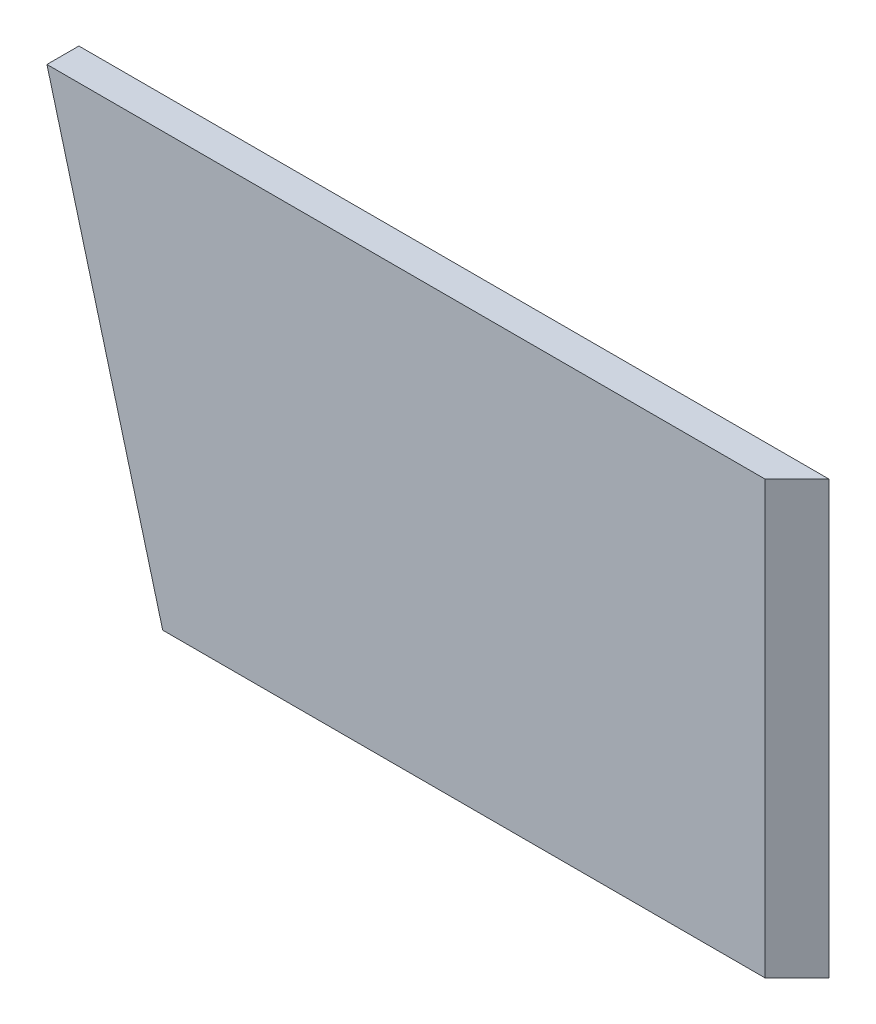
ISO-10303-21;
HEADER;
FILE_DESCRIPTION(('STEP AP214'),'2;1');
FILE_NAME('part.step','',(''),(''),'','','');
FILE_SCHEMA(('AUTOMOTIVE_DESIGN { 1 0 10303 214 1 1 1 1 }'));
ENDSEC;
DATA;
#1=APPLICATION_CONTEXT('core data for automotive mechanical design processes');
#2=APPLICATION_PROTOCOL_DEFINITION('international standard','automotive_design',2000,#1);
#3=PRODUCT_CONTEXT('',#1,'mechanical');
#4=PRODUCT('Part','Part','',(#3));
#5=PRODUCT_RELATED_PRODUCT_CATEGORY('part','',(#4));
#6=PRODUCT_DEFINITION_FORMATION('','',#4);
#7=PRODUCT_DEFINITION_CONTEXT('part definition',#1,'design');
#8=PRODUCT_DEFINITION('design','',#6,#7);
#9=PRODUCT_DEFINITION_SHAPE('','',#8);
#10=(LENGTH_UNIT() NAMED_UNIT(*) SI_UNIT(.MILLI.,.METRE.));
#11=(NAMED_UNIT(*) PLANE_ANGLE_UNIT() SI_UNIT($,.RADIAN.));
#12=(NAMED_UNIT(*) SI_UNIT($,.STERADIAN.) SOLID_ANGLE_UNIT());
#13=UNCERTAINTY_MEASURE_WITH_UNIT(LENGTH_MEASURE(1.E-05),#10,'distance_accuracy_value','');
#14=(GEOMETRIC_REPRESENTATION_CONTEXT(3) GLOBAL_UNCERTAINTY_ASSIGNED_CONTEXT((#13)) GLOBAL_UNIT_ASSIGNED_CONTEXT((#10,
#11,#12)) REPRESENTATION_CONTEXT('',''));
#15=CARTESIAN_POINT('',(0.,0.,0.));
#16=DIRECTION('',(0.,0.,1.));
#17=DIRECTION('',(1.,0.,0.));
#18=AXIS2_PLACEMENT_3D('',#15,#16,#17);
#19=CARTESIAN_POINT('',(-12.7,0.,381.));
#20=DIRECTION('',(0.,1.,0.));
#21=DIRECTION('',(0.,0.,1.));
#22=AXIS2_PLACEMENT_3D('',#19,#20,#21);
#23=PLANE('',#22);
#24=DIRECTION('',(1.,0.,0.));
#25=VECTOR('',#24,1.);
#26=CARTESIAN_POINT('',(-12.7,0.,0.));
#27=LINE('',#26,#25);
#28=CARTESIAN_POINT('',(-252.1712,0.,-1.11986508954942E-13));
#29=VERTEX_POINT('',#28);
#30=CARTESIAN_POINT('',(-1.2622723488703E-12,0.,0.));
#31=VERTEX_POINT('',#30);
#32=EDGE_CURVE('E87',#29,#31,#27,.T.);
#33=ORIENTED_EDGE('',*,*,#32,.T.);
#34=DIRECTION('',(-0.707106781186514,0.,0.707106781186581));
#35=VECTOR('',#34,1.);
#36=CARTESIAN_POINT('',(-1.2622723488703E-12,0.,0.));
#37=LINE('',#36,#35);
#38=CARTESIAN_POINT('',(-12.7000000000013,0.,12.7000000000012));
#39=VERTEX_POINT('',#38);
#40=EDGE_CURVE('E75',#31,#39,#37,.T.);
#41=ORIENTED_EDGE('',*,*,#40,.T.);
#42=DIRECTION('',(1.,0.,0.));
#43=VECTOR('',#42,1.);
#44=CARTESIAN_POINT('',(-381.,0.,12.6999999999999));
#45=LINE('',#44,#43);
#46=CARTESIAN_POINT('',(-252.1712,0.,12.7000000000012));
#47=VERTEX_POINT('',#46);
#48=EDGE_CURVE('E99',#47,#39,#45,.T.);
#49=ORIENTED_EDGE('',*,*,#48,.F.);
#50=DIRECTION('',(0.,0.,-1.));
#51=VECTOR('',#50,1.);
#52=CARTESIAN_POINT('',(-252.1712,0.,12.7000000000012));
#53=LINE('',#52,#51);
#54=EDGE_CURVE('E88',#47,#29,#53,.T.);
#55=ORIENTED_EDGE('',*,*,#54,.T.);
#56=EDGE_LOOP('',(#33,#41,#49,#55));
#57=FACE_BOUND('',#56,.T.);
#58=ADVANCED_FACE('F38',(#57),#23,.F.);
#59=CARTESIAN_POINT('',(-1.2622723488703E-12,171.7294,381.));
#60=DIRECTION('',(0.,-1.,0.));
#61=DIRECTION('',(0.,0.,-1.));
#62=AXIS2_PLACEMENT_3D('',#59,#60,#61);
#63=PLANE('',#62);
#64=DIRECTION('',(1.,0.,0.));
#65=VECTOR('',#64,1.);
#66=CARTESIAN_POINT('',(-381.,171.7294,12.7000000000011));
#67=LINE('',#66,#65);
#68=CARTESIAN_POINT('',(-298.185954046681,171.7294,12.7000000000024));
#69=VERTEX_POINT('',#68);
#70=CARTESIAN_POINT('',(-12.7000000000013,171.7294,12.7000000000012));
#71=VERTEX_POINT('',#70);
#72=EDGE_CURVE('E102',#69,#71,#67,.T.);
#73=ORIENTED_EDGE('',*,*,#72,.T.);
#74=DIRECTION('',(-0.707106781186514,0.,0.707106781186581));
#75=VECTOR('',#74,1.);
#76=CARTESIAN_POINT('',(-1.2622723488703E-12,171.7294,0.));
#77=LINE('',#76,#75);
#78=CARTESIAN_POINT('',(-1.2622723488703E-12,171.7294,0.));
#79=VERTEX_POINT('',#78);
#80=EDGE_CURVE('E53',#79,#71,#77,.T.);
#81=ORIENTED_EDGE('',*,*,#80,.F.);
#82=DIRECTION('',(-1.,0.,0.));
#83=VECTOR('',#82,1.);
#84=CARTESIAN_POINT('',(-1.2622723488703E-12,171.7294,0.));
#85=LINE('',#84,#83);
#86=CARTESIAN_POINT('',(-298.185954046681,171.7294,1.12985118414933E-12));
#87=VERTEX_POINT('',#86);
#88=EDGE_CURVE('E11',#79,#87,#85,.T.);
#89=ORIENTED_EDGE('',*,*,#88,.T.);
#90=DIRECTION('',(0.,0.,-1.));
#91=VECTOR('',#90,1.);
#92=CARTESIAN_POINT('',(-298.185954046681,171.7294,12.7000000000024));
#93=LINE('',#92,#91);
#94=EDGE_CURVE('E106',#69,#87,#93,.T.);
#95=ORIENTED_EDGE('',*,*,#94,.F.);
#96=EDGE_LOOP('',(#73,#81,#89,#95));
#97=FACE_BOUND('',#96,.T.);
#98=ADVANCED_FACE('F124',(#97),#63,.F.);
#99=CARTESIAN_POINT('',(0.,0.,0.));
#100=DIRECTION('',(0.,0.,1.));
#101=DIRECTION('',(1.,0.,0.));
#102=AXIS2_PLACEMENT_3D('',#99,#100,#101);
#103=PLANE('',#102);
#104=ORIENTED_EDGE('',*,*,#32,.F.);
#105=DIRECTION('',(-0.258819045102522,0.965925826289068,0.));
#106=VECTOR('',#105,1.);
#107=CARTESIAN_POINT('',(-252.1712,0.,-1.11986508954942E-13));
#108=LINE('',#107,#106);
#109=EDGE_CURVE('E84',#29,#87,#108,.T.);
#110=ORIENTED_EDGE('',*,*,#109,.T.);
#111=ORIENTED_EDGE('',*,*,#88,.F.);
#112=DIRECTION('',(0.,1.,0.));
#113=VECTOR('',#112,1.);
#114=CARTESIAN_POINT('',(0.,0.,0.));
#115=LINE('',#114,#113);
#116=EDGE_CURVE('E46',#31,#79,#115,.T.);
#117=ORIENTED_EDGE('',*,*,#116,.F.);
#118=EDGE_LOOP('',(#104,#110,#111,#117));
#119=FACE_BOUND('',#118,.T.);
#120=ADVANCED_FACE('F94',(#119),#103,.F.);
#121=CARTESIAN_POINT('',(-381.,171.7294,12.7000000000011));
#122=DIRECTION('',(0.,0.,-1.));
#123=DIRECTION('',(0.,1.,0.));
#124=AXIS2_PLACEMENT_3D('',#121,#122,#123);
#125=PLANE('',#124);
#126=ORIENTED_EDGE('',*,*,#48,.T.);
#127=DIRECTION('',(0.,1.,0.));
#128=VECTOR('',#127,1.);
#129=CARTESIAN_POINT('',(-12.7000000000013,171.729400000003,12.7000000000012));
#130=LINE('',#129,#128);
#131=EDGE_CURVE('E79',#39,#71,#130,.T.);
#132=ORIENTED_EDGE('',*,*,#131,.T.);
#133=ORIENTED_EDGE('',*,*,#72,.F.);
#134=DIRECTION('',(-0.258819045102522,0.965925826289068,0.));
#135=VECTOR('',#134,1.);
#136=CARTESIAN_POINT('',(-252.1712,0.,12.7000000000012));
#137=LINE('',#136,#135);
#138=EDGE_CURVE('E109',#47,#69,#137,.T.);
#139=ORIENTED_EDGE('',*,*,#138,.F.);
#140=EDGE_LOOP('',(#126,#132,#133,#139));
#141=FACE_BOUND('',#140,.T.);
#142=ADVANCED_FACE('F123',(#141),#125,.F.);
#143=CARTESIAN_POINT('',(-252.1712,0.,12.7000000000012));
#144=DIRECTION('',(0.965925826289068,0.258819045102522,0.));
#145=DIRECTION('',(-0.258819045102522,0.965925826289068,0.));
#146=AXIS2_PLACEMENT_3D('',#143,#144,#145);
#147=PLANE('',#146);
#148=ORIENTED_EDGE('',*,*,#109,.F.);
#149=ORIENTED_EDGE('',*,*,#54,.F.);
#150=ORIENTED_EDGE('',*,*,#138,.T.);
#151=ORIENTED_EDGE('',*,*,#94,.T.);
#152=EDGE_LOOP('',(#148,#149,#150,#151));
#153=FACE_BOUND('',#152,.T.);
#154=ADVANCED_FACE('F121',(#153),#147,.F.);
#155=CARTESIAN_POINT('',(-1.2622723488703E-12,0.,0.));
#156=DIRECTION('',(-0.707106781186581,0.,-0.707106781186514));
#157=DIRECTION('',(-0.707106781186514,0.,0.707106781186581));
#158=AXIS2_PLACEMENT_3D('',#155,#156,#157);
#159=PLANE('',#158);
#160=ORIENTED_EDGE('',*,*,#80,.T.);
#161=ORIENTED_EDGE('',*,*,#131,.F.);
#162=ORIENTED_EDGE('',*,*,#40,.F.);
#163=ORIENTED_EDGE('',*,*,#116,.T.);
#164=EDGE_LOOP('',(#160,#161,#162,#163));
#165=FACE_BOUND('',#164,.T.);
#166=ADVANCED_FACE('F77',(#165),#159,.F.);
#167=CLOSED_SHELL('',(#58,#98,#120,#142,#154,#166));
#168=MANIFOLD_SOLID_BREP('B2',#167);
#169=ADVANCED_BREP_SHAPE_REPRESENTATION('',(#18,#168),#14);
#170=SHAPE_DEFINITION_REPRESENTATION(#9,#169);
ENDSEC;
END-ISO-10303-21;
